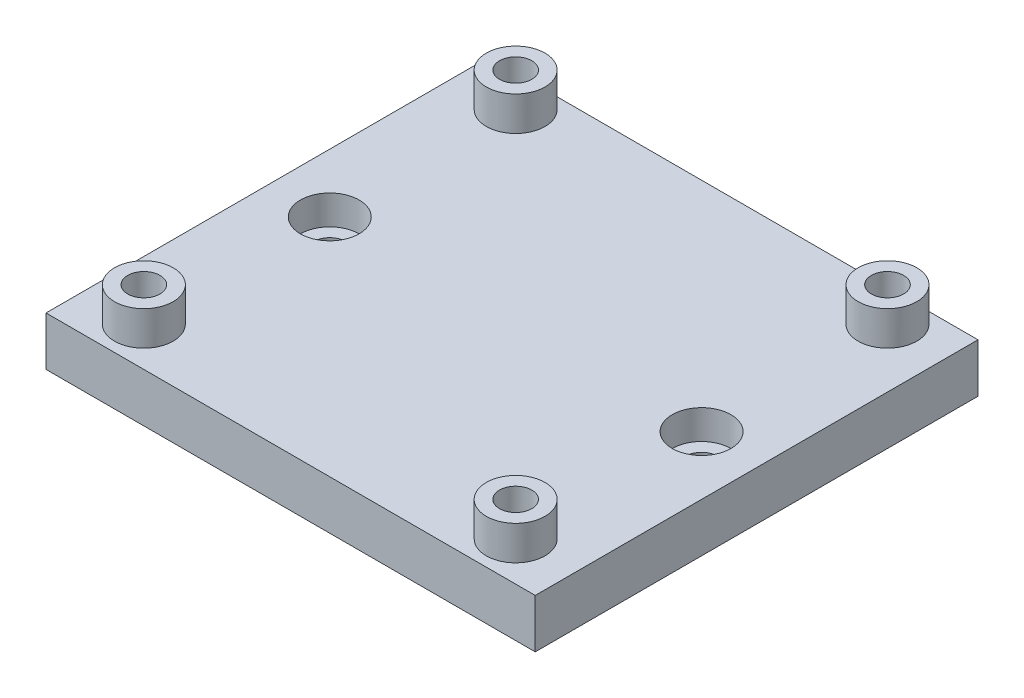
ISO-10303-21;
HEADER;
FILE_DESCRIPTION(('STEP AP214'),'2;1');
FILE_NAME('part.step','',(''),(''),'','','');
FILE_SCHEMA(('AUTOMOTIVE_DESIGN { 1 0 10303 214 1 1 1 1 }'));
ENDSEC;
DATA;
#1=APPLICATION_CONTEXT('core data for automotive mechanical design processes');
#2=APPLICATION_PROTOCOL_DEFINITION('international standard','automotive_design',2000,#1);
#3=PRODUCT_CONTEXT('',#1,'mechanical');
#4=PRODUCT('Part','Part','',(#3));
#5=PRODUCT_RELATED_PRODUCT_CATEGORY('part','',(#4));
#6=PRODUCT_DEFINITION_FORMATION('','',#4);
#7=PRODUCT_DEFINITION_CONTEXT('part definition',#1,'design');
#8=PRODUCT_DEFINITION('design','',#6,#7);
#9=PRODUCT_DEFINITION_SHAPE('','',#8);
#10=(LENGTH_UNIT() NAMED_UNIT(*) SI_UNIT(.MILLI.,.METRE.));
#11=(NAMED_UNIT(*) PLANE_ANGLE_UNIT() SI_UNIT($,.RADIAN.));
#12=(NAMED_UNIT(*) SI_UNIT($,.STERADIAN.) SOLID_ANGLE_UNIT());
#13=UNCERTAINTY_MEASURE_WITH_UNIT(LENGTH_MEASURE(1.E-05),#10,'distance_accuracy_value','');
#14=(GEOMETRIC_REPRESENTATION_CONTEXT(3) GLOBAL_UNCERTAINTY_ASSIGNED_CONTEXT((#13)) GLOBAL_UNIT_ASSIGNED_CONTEXT((#10,
#11,#12)) REPRESENTATION_CONTEXT('',''));
#15=CARTESIAN_POINT('',(0.,0.,0.));
#16=DIRECTION('',(0.,0.,1.));
#17=DIRECTION('',(1.,0.,0.));
#18=AXIS2_PLACEMENT_3D('',#15,#16,#17);
#19=CARTESIAN_POINT('',(6.,6.,-29.));
#20=DIRECTION('',(0.,-1.,0.));
#21=DIRECTION('',(0.,0.,-1.));
#22=AXIS2_PLACEMENT_3D('',#19,#20,#21);
#23=CYLINDRICAL_SURFACE('',#22,1.65);
#24=CARTESIAN_POINT('',(6.,3.,-29.));
#25=DIRECTION('',(0.,1.,0.));
#26=DIRECTION('',(0.,0.,1.));
#27=AXIS2_PLACEMENT_3D('',#24,#25,#26);
#28=CIRCLE('',#27,1.65);
#29=CARTESIAN_POINT('',(6.,3.,-27.35));
#30=VERTEX_POINT('',#29);
#31=EDGE_CURVE('E115',#30,#30,#28,.T.);
#32=ORIENTED_EDGE('',*,*,#31,.T.);
#33=EDGE_LOOP('',(#32));
#34=FACE_BOUND('',#33,.T.);
#35=CARTESIAN_POINT('',(6.,1.,-29.));
#36=DIRECTION('',(0.,-1.,0.));
#37=DIRECTION('',(0.,0.,-1.));
#38=AXIS2_PLACEMENT_3D('',#35,#36,#37);
#39=CIRCLE('',#38,1.65);
#40=CARTESIAN_POINT('',(6.,1.,-30.65));
#41=VERTEX_POINT('',#40);
#42=EDGE_CURVE('E100',#41,#41,#39,.T.);
#43=ORIENTED_EDGE('',*,*,#42,.T.);
#44=EDGE_LOOP('',(#43));
#45=FACE_BOUND('',#44,.T.);
#46=ADVANCED_FACE('F32',(#34,#45),#23,.F.);
#47=CARTESIAN_POINT('',(44.,6.,-29.));
#48=DIRECTION('',(0.,-1.,0.));
#49=DIRECTION('',(0.,0.,-1.));
#50=AXIS2_PLACEMENT_3D('',#47,#48,#49);
#51=CYLINDRICAL_SURFACE('',#50,1.65);
#52=CARTESIAN_POINT('',(44.,3.,-29.));
#53=DIRECTION('',(0.,1.,0.));
#54=DIRECTION('',(0.,0.,1.));
#55=AXIS2_PLACEMENT_3D('',#52,#53,#54);
#56=CIRCLE('',#55,1.65);
#57=CARTESIAN_POINT('',(44.,3.,-27.35));
#58=VERTEX_POINT('',#57);
#59=EDGE_CURVE('E105',#58,#58,#56,.T.);
#60=ORIENTED_EDGE('',*,*,#59,.T.);
#61=EDGE_LOOP('',(#60));
#62=FACE_BOUND('',#61,.T.);
#63=CARTESIAN_POINT('',(44.,1.,-29.));
#64=DIRECTION('',(0.,-1.,0.));
#65=DIRECTION('',(0.,0.,-1.));
#66=AXIS2_PLACEMENT_3D('',#63,#64,#65);
#67=CIRCLE('',#66,1.65);
#68=CARTESIAN_POINT('',(44.,1.,-30.65));
#69=VERTEX_POINT('',#68);
#70=EDGE_CURVE('E256',#69,#69,#67,.T.);
#71=ORIENTED_EDGE('',*,*,#70,.T.);
#72=EDGE_LOOP('',(#71));
#73=FACE_BOUND('',#72,.T.);
#74=ADVANCED_FACE('F206',(#62,#73),#51,.F.);
#75=CARTESIAN_POINT('',(0.,6.,0.));
#76=DIRECTION('',(1.,0.,0.));
#77=DIRECTION('',(0.,0.,-1.));
#78=AXIS2_PLACEMENT_3D('',#75,#76,#77);
#79=PLANE('',#78);
#80=DIRECTION('',(0.,0.,-1.));
#81=VECTOR('',#80,1.);
#82=CARTESIAN_POINT('',(0.,1.,-6.));
#83=LINE('',#82,#81);
#84=CARTESIAN_POINT('',(0.,1.,-6.));
#85=VERTEX_POINT('',#84);
#86=CARTESIAN_POINT('',(0.,1.,-51.25));
#87=VERTEX_POINT('',#86);
#88=EDGE_CURVE('E47',#85,#87,#83,.T.);
#89=ORIENTED_EDGE('',*,*,#88,.F.);
#90=DIRECTION('',(0.,1.,0.));
#91=VECTOR('',#90,1.);
#92=CARTESIAN_POINT('',(0.,-4.,-6.));
#93=LINE('',#92,#91);
#94=CARTESIAN_POINT('',(0.,6.,-6.));
#95=VERTEX_POINT('',#94);
#96=EDGE_CURVE('E99',#85,#95,#93,.T.);
#97=ORIENTED_EDGE('',*,*,#96,.T.);
#98=DIRECTION('',(0.,0.,1.));
#99=VECTOR('',#98,1.);
#100=CARTESIAN_POINT('',(0.,6.,0.));
#101=LINE('',#100,#99);
#102=CARTESIAN_POINT('',(0.,6.,-51.25));
#103=VERTEX_POINT('',#102);
#104=EDGE_CURVE('E136',#103,#95,#101,.T.);
#105=ORIENTED_EDGE('',*,*,#104,.F.);
#106=DIRECTION('',(0.,1.,0.));
#107=VECTOR('',#106,1.);
#108=CARTESIAN_POINT('',(0.,-4.,-51.25));
#109=LINE('',#108,#107);
#110=EDGE_CURVE('E87',#87,#103,#109,.T.);
#111=ORIENTED_EDGE('',*,*,#110,.F.);
#112=EDGE_LOOP('',(#89,#97,#105,#111));
#113=FACE_BOUND('',#112,.T.);
#114=ADVANCED_FACE('F34',(#113),#79,.F.);
#115=CARTESIAN_POINT('',(50.,6.,0.));
#116=DIRECTION('',(-1.,0.,0.));
#117=DIRECTION('',(0.,0.,1.));
#118=AXIS2_PLACEMENT_3D('',#115,#116,#117);
#119=PLANE('',#118);
#120=DIRECTION('',(0.,0.,1.));
#121=VECTOR('',#120,1.);
#122=CARTESIAN_POINT('',(50.,1.,-6.));
#123=LINE('',#122,#121);
#124=CARTESIAN_POINT('',(50.,1.,-51.25));
#125=VERTEX_POINT('',#124);
#126=CARTESIAN_POINT('',(50.,1.,-6.));
#127=VERTEX_POINT('',#126);
#128=EDGE_CURVE('E74',#125,#127,#123,.T.);
#129=ORIENTED_EDGE('',*,*,#128,.F.);
#130=DIRECTION('',(0.,1.,0.));
#131=VECTOR('',#130,1.);
#132=CARTESIAN_POINT('',(50.,-4.,-51.25));
#133=LINE('',#132,#131);
#134=CARTESIAN_POINT('',(50.,6.,-51.25));
#135=VERTEX_POINT('',#134);
#136=EDGE_CURVE('E55',#125,#135,#133,.T.);
#137=ORIENTED_EDGE('',*,*,#136,.T.);
#138=DIRECTION('',(0.,0.,-1.));
#139=VECTOR('',#138,1.);
#140=CARTESIAN_POINT('',(50.,6.,0.));
#141=LINE('',#140,#139);
#142=CARTESIAN_POINT('',(50.,6.,-6.));
#143=VERTEX_POINT('',#142);
#144=EDGE_CURVE('E139',#143,#135,#141,.T.);
#145=ORIENTED_EDGE('',*,*,#144,.F.);
#146=DIRECTION('',(0.,-1.,0.));
#147=VECTOR('',#146,1.);
#148=CARTESIAN_POINT('',(50.,6.,-6.));
#149=LINE('',#148,#147);
#150=EDGE_CURVE('E11',#143,#127,#149,.T.);
#151=ORIENTED_EDGE('',*,*,#150,.T.);
#152=EDGE_LOOP('',(#129,#137,#145,#151));
#153=FACE_BOUND('',#152,.T.);
#154=ADVANCED_FACE('F79',(#153),#119,.F.);
#155=CARTESIAN_POINT('',(44.,6.,-10.));
#156=DIRECTION('',(0.,-1.,0.));
#157=DIRECTION('',(0.,0.,-1.));
#158=AXIS2_PLACEMENT_3D('',#155,#156,#157);
#159=CYLINDRICAL_SURFACE('',#158,1.65);
#160=CARTESIAN_POINT('',(44.,9.5,-10.));
#161=DIRECTION('',(0.,1.,0.));
#162=DIRECTION('',(0.,0.,1.));
#163=AXIS2_PLACEMENT_3D('',#160,#161,#162);
#164=CIRCLE('',#163,1.65);
#165=CARTESIAN_POINT('',(44.,9.5,-8.35));
#166=VERTEX_POINT('',#165);
#167=EDGE_CURVE('E124',#166,#166,#164,.T.);
#168=ORIENTED_EDGE('',*,*,#167,.T.);
#169=EDGE_LOOP('',(#168));
#170=FACE_BOUND('',#169,.T.);
#171=CARTESIAN_POINT('',(44.,1.,-10.));
#172=DIRECTION('',(0.,-1.,0.));
#173=DIRECTION('',(0.,0.,-1.));
#174=AXIS2_PLACEMENT_3D('',#171,#172,#173);
#175=CIRCLE('',#174,1.65);
#176=CARTESIAN_POINT('',(44.,1.,-11.65));
#177=VERTEX_POINT('',#176);
#178=EDGE_CURVE('E253',#177,#177,#175,.T.);
#179=ORIENTED_EDGE('',*,*,#178,.T.);
#180=EDGE_LOOP('',(#179));
#181=FACE_BOUND('',#180,.T.);
#182=ADVANCED_FACE('F227',(#170,#181),#159,.F.);
#183=CARTESIAN_POINT('',(44.,6.,-48.));
#184=DIRECTION('',(0.,-1.,0.));
#185=DIRECTION('',(0.,0.,-1.));
#186=AXIS2_PLACEMENT_3D('',#183,#184,#185);
#187=CYLINDRICAL_SURFACE('',#186,1.65);
#188=CARTESIAN_POINT('',(44.,9.5,-48.));
#189=DIRECTION('',(0.,1.,0.));
#190=DIRECTION('',(0.,0.,1.));
#191=AXIS2_PLACEMENT_3D('',#188,#189,#190);
#192=CIRCLE('',#191,1.65);
#193=CARTESIAN_POINT('',(44.,9.5,-46.35));
#194=VERTEX_POINT('',#193);
#195=EDGE_CURVE('E111',#194,#194,#192,.T.);
#196=ORIENTED_EDGE('',*,*,#195,.T.);
#197=EDGE_LOOP('',(#196));
#198=FACE_BOUND('',#197,.T.);
#199=CARTESIAN_POINT('',(44.,1.,-48.));
#200=DIRECTION('',(0.,-1.,0.));
#201=DIRECTION('',(0.,0.,-1.));
#202=AXIS2_PLACEMENT_3D('',#199,#200,#201);
#203=CIRCLE('',#202,1.65);
#204=CARTESIAN_POINT('',(44.,1.,-49.65));
#205=VERTEX_POINT('',#204);
#206=EDGE_CURVE('E250',#205,#205,#203,.T.);
#207=ORIENTED_EDGE('',*,*,#206,.T.);
#208=EDGE_LOOP('',(#207));
#209=FACE_BOUND('',#208,.T.);
#210=ADVANCED_FACE('F223',(#198,#209),#187,.F.);
#211=CARTESIAN_POINT('',(6.,6.,-10.));
#212=DIRECTION('',(0.,-1.,0.));
#213=DIRECTION('',(0.,0.,-1.));
#214=AXIS2_PLACEMENT_3D('',#211,#212,#213);
#215=CYLINDRICAL_SURFACE('',#214,1.65);
#216=CARTESIAN_POINT('',(6.,9.5,-10.));
#217=DIRECTION('',(0.,1.,0.));
#218=DIRECTION('',(0.,0.,1.));
#219=AXIS2_PLACEMENT_3D('',#216,#217,#218);
#220=CIRCLE('',#219,1.65);
#221=CARTESIAN_POINT('',(6.,9.5,-8.35));
#222=VERTEX_POINT('',#221);
#223=EDGE_CURVE('E130',#222,#222,#220,.T.);
#224=ORIENTED_EDGE('',*,*,#223,.T.);
#225=EDGE_LOOP('',(#224));
#226=FACE_BOUND('',#225,.T.);
#227=CARTESIAN_POINT('',(6.,1.,-10.));
#228=DIRECTION('',(0.,-1.,0.));
#229=DIRECTION('',(0.,0.,-1.));
#230=AXIS2_PLACEMENT_3D('',#227,#228,#229);
#231=CIRCLE('',#230,1.65);
#232=CARTESIAN_POINT('',(6.,1.,-11.65));
#233=VERTEX_POINT('',#232);
#234=EDGE_CURVE('E245',#233,#233,#231,.T.);
#235=ORIENTED_EDGE('',*,*,#234,.T.);
#236=EDGE_LOOP('',(#235));
#237=FACE_BOUND('',#236,.T.);
#238=ADVANCED_FACE('F219',(#226,#237),#215,.F.);
#239=CARTESIAN_POINT('',(6.,6.,-48.));
#240=DIRECTION('',(0.,-1.,0.));
#241=DIRECTION('',(0.,0.,-1.));
#242=AXIS2_PLACEMENT_3D('',#239,#240,#241);
#243=CYLINDRICAL_SURFACE('',#242,1.65);
#244=CARTESIAN_POINT('',(6.,9.5,-48.));
#245=DIRECTION('',(0.,1.,0.));
#246=DIRECTION('',(0.,0.,1.));
#247=AXIS2_PLACEMENT_3D('',#244,#245,#246);
#248=CIRCLE('',#247,1.65);
#249=CARTESIAN_POINT('',(6.,9.5,-46.35));
#250=VERTEX_POINT('',#249);
#251=EDGE_CURVE('E118',#250,#250,#248,.T.);
#252=ORIENTED_EDGE('',*,*,#251,.T.);
#253=EDGE_LOOP('',(#252));
#254=FACE_BOUND('',#253,.T.);
#255=CARTESIAN_POINT('',(6.,1.,-48.));
#256=DIRECTION('',(0.,-1.,0.));
#257=DIRECTION('',(0.,0.,-1.));
#258=AXIS2_PLACEMENT_3D('',#255,#256,#257);
#259=CIRCLE('',#258,1.65);
#260=CARTESIAN_POINT('',(6.,1.,-49.65));
#261=VERTEX_POINT('',#260);
#262=EDGE_CURVE('E242',#261,#261,#259,.T.);
#263=ORIENTED_EDGE('',*,*,#262,.T.);
#264=EDGE_LOOP('',(#263));
#265=FACE_BOUND('',#264,.T.);
#266=ADVANCED_FACE('F215',(#254,#265),#243,.F.);
#267=CARTESIAN_POINT('',(0.,-4.,-6.));
#268=DIRECTION('',(0.,0.,-1.));
#269=DIRECTION('',(-1.,0.,0.));
#270=AXIS2_PLACEMENT_3D('',#267,#268,#269);
#271=PLANE('',#270);
#272=DIRECTION('',(-1.,0.,0.));
#273=VECTOR('',#272,1.);
#274=CARTESIAN_POINT('',(0.,1.,-6.));
#275=LINE('',#274,#273);
#276=EDGE_CURVE('E80',#127,#85,#275,.T.);
#277=ORIENTED_EDGE('',*,*,#276,.F.);
#278=ORIENTED_EDGE('',*,*,#150,.F.);
#279=DIRECTION('',(-1.,0.,0.));
#280=VECTOR('',#279,1.);
#281=CARTESIAN_POINT('',(0.,6.,-6.));
#282=LINE('',#281,#280);
#283=EDGE_CURVE('E96',#143,#95,#282,.T.);
#284=ORIENTED_EDGE('',*,*,#283,.T.);
#285=ORIENTED_EDGE('',*,*,#96,.F.);
#286=EDGE_LOOP('',(#277,#278,#284,#285));
#287=FACE_BOUND('',#286,.T.);
#288=ADVANCED_FACE('F218',(#287),#271,.F.);
#289=CARTESIAN_POINT('',(0.,-4.,-51.25));
#290=DIRECTION('',(0.,0.,1.));
#291=DIRECTION('',(1.,0.,0.));
#292=AXIS2_PLACEMENT_3D('',#289,#290,#291);
#293=PLANE('',#292);
#294=DIRECTION('',(1.,0.,0.));
#295=VECTOR('',#294,1.);
#296=CARTESIAN_POINT('',(0.,1.,-51.25));
#297=LINE('',#296,#295);
#298=EDGE_CURVE('E72',#87,#125,#297,.T.);
#299=ORIENTED_EDGE('',*,*,#298,.F.);
#300=ORIENTED_EDGE('',*,*,#110,.T.);
#301=DIRECTION('',(1.,0.,0.));
#302=VECTOR('',#301,1.);
#303=CARTESIAN_POINT('',(0.,6.,-51.25));
#304=LINE('',#303,#302);
#305=EDGE_CURVE('E84',#103,#135,#304,.T.);
#306=ORIENTED_EDGE('',*,*,#305,.T.);
#307=ORIENTED_EDGE('',*,*,#136,.F.);
#308=EDGE_LOOP('',(#299,#300,#306,#307));
#309=FACE_BOUND('',#308,.T.);
#310=ADVANCED_FACE('F82',(#309),#293,.F.);
#311=CARTESIAN_POINT('',(0.,6.,0.));
#312=DIRECTION('',(0.,-1.,0.));
#313=DIRECTION('',(0.,0.,-1.));
#314=AXIS2_PLACEMENT_3D('',#311,#312,#313);
#315=PLANE('',#314);
#316=CARTESIAN_POINT('',(6.,6.,-29.));
#317=DIRECTION('',(0.,1.,0.));
#318=DIRECTION('',(0.,0.,1.));
#319=AXIS2_PLACEMENT_3D('',#316,#317,#318);
#320=CIRCLE('',#319,3.);
#321=CARTESIAN_POINT('',(6.,6.,-26.));
#322=VERTEX_POINT('',#321);
#323=EDGE_CURVE('E106',#322,#322,#320,.T.);
#324=ORIENTED_EDGE('',*,*,#323,.F.);
#325=EDGE_LOOP('',(#324));
#326=FACE_BOUND('',#325,.T.);
#327=CARTESIAN_POINT('',(44.,6.,-29.));
#328=DIRECTION('',(0.,1.,0.));
#329=DIRECTION('',(0.,0.,1.));
#330=AXIS2_PLACEMENT_3D('',#327,#328,#329);
#331=CIRCLE('',#330,3.);
#332=CARTESIAN_POINT('',(44.,6.,-26.));
#333=VERTEX_POINT('',#332);
#334=EDGE_CURVE('E86',#333,#333,#331,.T.);
#335=ORIENTED_EDGE('',*,*,#334,.F.);
#336=EDGE_LOOP('',(#335));
#337=FACE_BOUND('',#336,.T.);
#338=CARTESIAN_POINT('',(6.,6.,-48.));
#339=DIRECTION('',(0.,-1.,0.));
#340=DIRECTION('',(0.,0.,-1.));
#341=AXIS2_PLACEMENT_3D('',#338,#339,#340);
#342=CIRCLE('',#341,3.);
#343=CARTESIAN_POINT('',(6.,6.,-51.));
#344=VERTEX_POINT('',#343);
#345=EDGE_CURVE('E147',#344,#344,#342,.F.);
#346=ORIENTED_EDGE('',*,*,#345,.F.);
#347=EDGE_LOOP('',(#346));
#348=FACE_BOUND('',#347,.T.);
#349=CARTESIAN_POINT('',(6.,6.,-10.));
#350=DIRECTION('',(0.,-1.,0.));
#351=DIRECTION('',(0.,0.,-1.));
#352=AXIS2_PLACEMENT_3D('',#349,#350,#351);
#353=CIRCLE('',#352,3.);
#354=CARTESIAN_POINT('',(6.,6.,-13.));
#355=VERTEX_POINT('',#354);
#356=EDGE_CURVE('E141',#355,#355,#353,.F.);
#357=ORIENTED_EDGE('',*,*,#356,.F.);
#358=EDGE_LOOP('',(#357));
#359=FACE_BOUND('',#358,.T.);
#360=ORIENTED_EDGE('',*,*,#144,.T.);
#361=ORIENTED_EDGE('',*,*,#305,.F.);
#362=ORIENTED_EDGE('',*,*,#104,.T.);
#363=ORIENTED_EDGE('',*,*,#283,.F.);
#364=EDGE_LOOP('',(#360,#361,#362,#363));
#365=FACE_BOUND('',#364,.T.);
#366=CARTESIAN_POINT('',(44.,6.,-10.));
#367=DIRECTION('',(0.,-1.,0.));
#368=DIRECTION('',(0.,0.,-1.));
#369=AXIS2_PLACEMENT_3D('',#366,#367,#368);
#370=CIRCLE('',#369,3.);
#371=CARTESIAN_POINT('',(44.,6.,-13.));
#372=VERTEX_POINT('',#371);
#373=EDGE_CURVE('E144',#372,#372,#370,.F.);
#374=ORIENTED_EDGE('',*,*,#373,.F.);
#375=EDGE_LOOP('',(#374));
#376=FACE_BOUND('',#375,.T.);
#377=CARTESIAN_POINT('',(44.,6.,-48.));
#378=DIRECTION('',(0.,-1.,0.));
#379=DIRECTION('',(0.,0.,-1.));
#380=AXIS2_PLACEMENT_3D('',#377,#378,#379);
#381=CIRCLE('',#380,3.);
#382=CARTESIAN_POINT('',(44.,6.,-51.));
#383=VERTEX_POINT('',#382);
#384=EDGE_CURVE('E40',#383,#383,#381,.F.);
#385=ORIENTED_EDGE('',*,*,#384,.F.);
#386=EDGE_LOOP('',(#385));
#387=FACE_BOUND('',#386,.T.);
#388=ADVANCED_FACE('F171',(#326,#337,#348,#359,#365,#376,#387),#315,.F.);
#389=CARTESIAN_POINT('',(6.,9.5,-10.));
#390=DIRECTION('',(0.,1.,0.));
#391=DIRECTION('',(0.,0.,1.));
#392=AXIS2_PLACEMENT_3D('',#389,#390,#391);
#393=PLANE('',#392);
#394=CARTESIAN_POINT('',(6.,9.5,-10.));
#395=DIRECTION('',(0.,1.,0.));
#396=DIRECTION('',(0.,0.,1.));
#397=AXIS2_PLACEMENT_3D('',#394,#395,#396);
#398=CIRCLE('',#397,3.);
#399=CARTESIAN_POINT('',(6.,9.5,-7.));
#400=VERTEX_POINT('',#399);
#401=EDGE_CURVE('E133',#400,#400,#398,.T.);
#402=ORIENTED_EDGE('',*,*,#401,.T.);
#403=EDGE_LOOP('',(#402));
#404=FACE_BOUND('',#403,.T.);
#405=ORIENTED_EDGE('',*,*,#223,.F.);
#406=EDGE_LOOP('',(#405));
#407=FACE_BOUND('',#406,.T.);
#408=ADVANCED_FACE('F174',(#404,#407),#393,.T.);
#409=CARTESIAN_POINT('',(6.,9.5,-10.));
#410=DIRECTION('',(0.,-1.,0.));
#411=DIRECTION('',(0.,0.,-1.));
#412=AXIS2_PLACEMENT_3D('',#409,#410,#411);
#413=CYLINDRICAL_SURFACE('',#412,3.);
#414=ORIENTED_EDGE('',*,*,#401,.F.);
#415=EDGE_LOOP('',(#414));
#416=FACE_BOUND('',#415,.T.);
#417=ORIENTED_EDGE('',*,*,#356,.T.);
#418=EDGE_LOOP('',(#417));
#419=FACE_BOUND('',#418,.T.);
#420=ADVANCED_FACE('F388',(#416,#419),#413,.T.);
#421=CARTESIAN_POINT('',(44.,9.5,-10.));
#422=DIRECTION('',(0.,1.,0.));
#423=DIRECTION('',(0.,0.,1.));
#424=AXIS2_PLACEMENT_3D('',#421,#422,#423);
#425=PLANE('',#424);
#426=CARTESIAN_POINT('',(44.,9.5,-10.));
#427=DIRECTION('',(0.,1.,0.));
#428=DIRECTION('',(0.,0.,1.));
#429=AXIS2_PLACEMENT_3D('',#426,#427,#428);
#430=CIRCLE('',#429,3.);
#431=CARTESIAN_POINT('',(44.,9.5,-7.));
#432=VERTEX_POINT('',#431);
#433=EDGE_CURVE('E127',#432,#432,#430,.T.);
#434=ORIENTED_EDGE('',*,*,#433,.T.);
#435=EDGE_LOOP('',(#434));
#436=FACE_BOUND('',#435,.T.);
#437=ORIENTED_EDGE('',*,*,#167,.F.);
#438=EDGE_LOOP('',(#437));
#439=FACE_BOUND('',#438,.T.);
#440=ADVANCED_FACE('F395',(#436,#439),#425,.T.);
#441=CARTESIAN_POINT('',(44.,9.5,-10.));
#442=DIRECTION('',(0.,-1.,0.));
#443=DIRECTION('',(0.,0.,-1.));
#444=AXIS2_PLACEMENT_3D('',#441,#442,#443);
#445=CYLINDRICAL_SURFACE('',#444,3.);
#446=ORIENTED_EDGE('',*,*,#433,.F.);
#447=EDGE_LOOP('',(#446));
#448=FACE_BOUND('',#447,.T.);
#449=ORIENTED_EDGE('',*,*,#373,.T.);
#450=EDGE_LOOP('',(#449));
#451=FACE_BOUND('',#450,.T.);
#452=ADVANCED_FACE('F402',(#448,#451),#445,.T.);
#453=CARTESIAN_POINT('',(6.,9.5,-48.));
#454=DIRECTION('',(0.,1.,0.));
#455=DIRECTION('',(0.,0.,1.));
#456=AXIS2_PLACEMENT_3D('',#453,#454,#455);
#457=PLANE('',#456);
#458=CARTESIAN_POINT('',(6.,9.5,-48.));
#459=DIRECTION('',(0.,1.,0.));
#460=DIRECTION('',(0.,0.,1.));
#461=AXIS2_PLACEMENT_3D('',#458,#459,#460);
#462=CIRCLE('',#461,3.);
#463=CARTESIAN_POINT('',(6.,9.5,-45.));
#464=VERTEX_POINT('',#463);
#465=EDGE_CURVE('E121',#464,#464,#462,.T.);
#466=ORIENTED_EDGE('',*,*,#465,.T.);
#467=EDGE_LOOP('',(#466));
#468=FACE_BOUND('',#467,.T.);
#469=ORIENTED_EDGE('',*,*,#251,.F.);
#470=EDGE_LOOP('',(#469));
#471=FACE_BOUND('',#470,.T.);
#472=ADVANCED_FACE('F410',(#468,#471),#457,.T.);
#473=CARTESIAN_POINT('',(6.,9.5,-48.));
#474=DIRECTION('',(0.,-1.,0.));
#475=DIRECTION('',(0.,0.,-1.));
#476=AXIS2_PLACEMENT_3D('',#473,#474,#475);
#477=CYLINDRICAL_SURFACE('',#476,3.);
#478=ORIENTED_EDGE('',*,*,#465,.F.);
#479=EDGE_LOOP('',(#478));
#480=FACE_BOUND('',#479,.T.);
#481=ORIENTED_EDGE('',*,*,#345,.T.);
#482=EDGE_LOOP('',(#481));
#483=FACE_BOUND('',#482,.T.);
#484=ADVANCED_FACE('F200',(#480,#483),#477,.T.);
#485=CARTESIAN_POINT('',(44.,9.5,-48.));
#486=DIRECTION('',(0.,1.,0.));
#487=DIRECTION('',(0.,0.,1.));
#488=AXIS2_PLACEMENT_3D('',#485,#486,#487);
#489=PLANE('',#488);
#490=CARTESIAN_POINT('',(44.,9.5,-48.));
#491=DIRECTION('',(0.,1.,0.));
#492=DIRECTION('',(0.,0.,1.));
#493=AXIS2_PLACEMENT_3D('',#490,#491,#492);
#494=CIRCLE('',#493,3.);
#495=CARTESIAN_POINT('',(44.,9.5,-45.));
#496=VERTEX_POINT('',#495);
#497=EDGE_CURVE('E114',#496,#496,#494,.T.);
#498=ORIENTED_EDGE('',*,*,#497,.T.);
#499=EDGE_LOOP('',(#498));
#500=FACE_BOUND('',#499,.T.);
#501=ORIENTED_EDGE('',*,*,#195,.F.);
#502=EDGE_LOOP('',(#501));
#503=FACE_BOUND('',#502,.T.);
#504=ADVANCED_FACE('F191',(#500,#503),#489,.T.);
#505=CARTESIAN_POINT('',(44.,9.5,-48.));
#506=DIRECTION('',(0.,-1.,0.));
#507=DIRECTION('',(0.,0.,-1.));
#508=AXIS2_PLACEMENT_3D('',#505,#506,#507);
#509=CYLINDRICAL_SURFACE('',#508,3.);
#510=ORIENTED_EDGE('',*,*,#497,.F.);
#511=EDGE_LOOP('',(#510));
#512=FACE_BOUND('',#511,.T.);
#513=ORIENTED_EDGE('',*,*,#384,.T.);
#514=EDGE_LOOP('',(#513));
#515=FACE_BOUND('',#514,.T.);
#516=ADVANCED_FACE('F188',(#512,#515),#509,.T.);
#517=CARTESIAN_POINT('',(44.,3.,-29.));
#518=DIRECTION('',(0.,1.,0.));
#519=DIRECTION('',(0.,0.,1.));
#520=AXIS2_PLACEMENT_3D('',#517,#518,#519);
#521=CYLINDRICAL_SURFACE('',#520,3.);
#522=CARTESIAN_POINT('',(44.,3.,-29.));
#523=DIRECTION('',(0.,1.,0.));
#524=DIRECTION('',(0.,0.,1.));
#525=AXIS2_PLACEMENT_3D('',#522,#523,#524);
#526=CIRCLE('',#525,3.);
#527=CARTESIAN_POINT('',(44.,3.,-26.));
#528=VERTEX_POINT('',#527);
#529=EDGE_CURVE('E90',#528,#528,#526,.T.);
#530=ORIENTED_EDGE('',*,*,#529,.F.);
#531=EDGE_LOOP('',(#530));
#532=FACE_BOUND('',#531,.T.);
#533=ORIENTED_EDGE('',*,*,#334,.T.);
#534=EDGE_LOOP('',(#533));
#535=FACE_BOUND('',#534,.T.);
#536=ADVANCED_FACE('F190',(#532,#535),#521,.F.);
#537=CARTESIAN_POINT('',(44.,3.,-29.));
#538=DIRECTION('',(0.,1.,0.));
#539=DIRECTION('',(0.,0.,1.));
#540=AXIS2_PLACEMENT_3D('',#537,#538,#539);
#541=PLANE('',#540);
#542=ORIENTED_EDGE('',*,*,#59,.F.);
#543=EDGE_LOOP('',(#542));
#544=FACE_BOUND('',#543,.T.);
#545=ORIENTED_EDGE('',*,*,#529,.T.);
#546=EDGE_LOOP('',(#545));
#547=FACE_BOUND('',#546,.T.);
#548=ADVANCED_FACE('F167',(#544,#547),#541,.T.);
#549=CARTESIAN_POINT('',(6.,3.,-29.));
#550=DIRECTION('',(0.,1.,0.));
#551=DIRECTION('',(0.,0.,1.));
#552=AXIS2_PLACEMENT_3D('',#549,#550,#551);
#553=CYLINDRICAL_SURFACE('',#552,3.);
#554=CARTESIAN_POINT('',(6.,3.,-29.));
#555=DIRECTION('',(0.,1.,0.));
#556=DIRECTION('',(0.,0.,1.));
#557=AXIS2_PLACEMENT_3D('',#554,#555,#556);
#558=CIRCLE('',#557,3.);
#559=CARTESIAN_POINT('',(6.,3.,-26.));
#560=VERTEX_POINT('',#559);
#561=EDGE_CURVE('E102',#560,#560,#558,.T.);
#562=ORIENTED_EDGE('',*,*,#561,.F.);
#563=EDGE_LOOP('',(#562));
#564=FACE_BOUND('',#563,.T.);
#565=ORIENTED_EDGE('',*,*,#323,.T.);
#566=EDGE_LOOP('',(#565));
#567=FACE_BOUND('',#566,.T.);
#568=ADVANCED_FACE('F161',(#564,#567),#553,.F.);
#569=CARTESIAN_POINT('',(6.,3.,-29.));
#570=DIRECTION('',(0.,1.,0.));
#571=DIRECTION('',(0.,0.,1.));
#572=AXIS2_PLACEMENT_3D('',#569,#570,#571);
#573=PLANE('',#572);
#574=ORIENTED_EDGE('',*,*,#31,.F.);
#575=EDGE_LOOP('',(#574));
#576=FACE_BOUND('',#575,.T.);
#577=ORIENTED_EDGE('',*,*,#561,.T.);
#578=EDGE_LOOP('',(#577));
#579=FACE_BOUND('',#578,.T.);
#580=ADVANCED_FACE('F158',(#576,#579),#573,.T.);
#581=CARTESIAN_POINT('',(0.,1.,0.));
#582=DIRECTION('',(0.,-1.,0.));
#583=DIRECTION('',(0.,0.,-1.));
#584=AXIS2_PLACEMENT_3D('',#581,#582,#583);
#585=PLANE('',#584);
#586=ORIENTED_EDGE('',*,*,#42,.F.);
#587=EDGE_LOOP('',(#586));
#588=FACE_BOUND('',#587,.T.);
#589=ORIENTED_EDGE('',*,*,#70,.F.);
#590=EDGE_LOOP('',(#589));
#591=FACE_BOUND('',#590,.T.);
#592=ORIENTED_EDGE('',*,*,#178,.F.);
#593=EDGE_LOOP('',(#592));
#594=FACE_BOUND('',#593,.T.);
#595=ORIENTED_EDGE('',*,*,#206,.F.);
#596=EDGE_LOOP('',(#595));
#597=FACE_BOUND('',#596,.T.);
#598=ORIENTED_EDGE('',*,*,#234,.F.);
#599=EDGE_LOOP('',(#598));
#600=FACE_BOUND('',#599,.T.);
#601=ORIENTED_EDGE('',*,*,#262,.F.);
#602=EDGE_LOOP('',(#601));
#603=FACE_BOUND('',#602,.T.);
#604=ORIENTED_EDGE('',*,*,#88,.T.);
#605=ORIENTED_EDGE('',*,*,#298,.T.);
#606=ORIENTED_EDGE('',*,*,#128,.T.);
#607=ORIENTED_EDGE('',*,*,#276,.T.);
#608=EDGE_LOOP('',(#604,#605,#606,#607));
#609=FACE_BOUND('',#608,.T.);
#610=ADVANCED_FACE('F73',(#588,#591,#594,#597,#600,#603,#609),#585,.T.);
#611=CLOSED_SHELL('',(#46,#74,#114,#154,#182,#210,#238,#266,#288,#310,#388,#408,#420,#440,#452,
#472,#484,#504,#516,#536,#548,#568,#580,#610));
#612=MANIFOLD_SOLID_BREP('B2',#611);
#613=ADVANCED_BREP_SHAPE_REPRESENTATION('',(#18,#612),#14);
#614=SHAPE_DEFINITION_REPRESENTATION(#9,#613);
ENDSEC;
END-ISO-10303-21;
